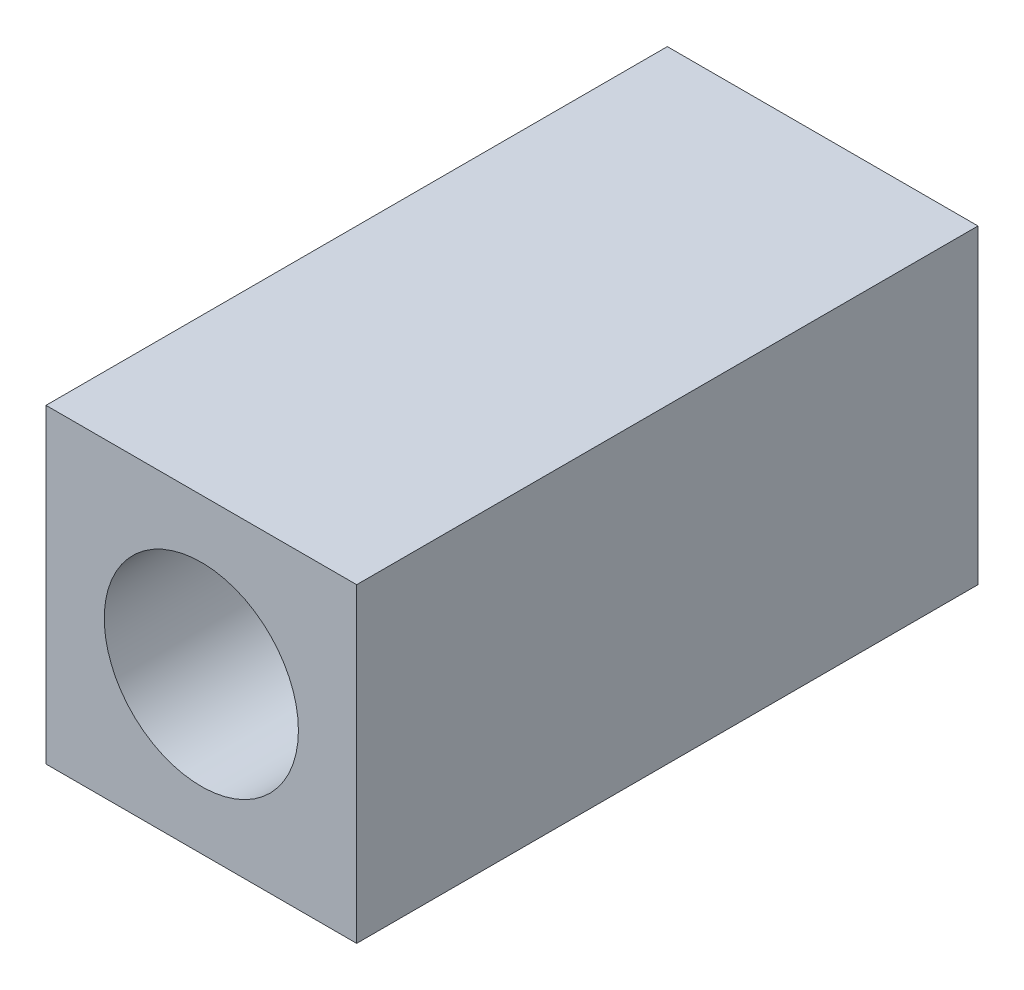
ISO-10303-21;
HEADER;
FILE_DESCRIPTION(('STEP AP214'),'2;1');
FILE_NAME('part.step','',(''),(''),'','','');
FILE_SCHEMA(('AUTOMOTIVE_DESIGN { 1 0 10303 214 1 1 1 1 }'));
ENDSEC;
DATA;
#1=APPLICATION_CONTEXT('core data for automotive mechanical design processes');
#2=APPLICATION_PROTOCOL_DEFINITION('international standard','automotive_design',2000,#1);
#3=PRODUCT_CONTEXT('',#1,'mechanical');
#4=PRODUCT('Part','Part','',(#3));
#5=PRODUCT_RELATED_PRODUCT_CATEGORY('part','',(#4));
#6=PRODUCT_DEFINITION_FORMATION('','',#4);
#7=PRODUCT_DEFINITION_CONTEXT('part definition',#1,'design');
#8=PRODUCT_DEFINITION('design','',#6,#7);
#9=PRODUCT_DEFINITION_SHAPE('','',#8);
#10=(LENGTH_UNIT() NAMED_UNIT(*) SI_UNIT(.MILLI.,.METRE.));
#11=(NAMED_UNIT(*) PLANE_ANGLE_UNIT() SI_UNIT($,.RADIAN.));
#12=(NAMED_UNIT(*) SI_UNIT($,.STERADIAN.) SOLID_ANGLE_UNIT());
#13=UNCERTAINTY_MEASURE_WITH_UNIT(LENGTH_MEASURE(1.E-05),#10,'distance_accuracy_value','');
#14=(GEOMETRIC_REPRESENTATION_CONTEXT(3) GLOBAL_UNCERTAINTY_ASSIGNED_CONTEXT((#13)) GLOBAL_UNIT_ASSIGNED_CONTEXT((#10,
#11,#12)) REPRESENTATION_CONTEXT('',''));
#15=CARTESIAN_POINT('',(0.,0.,0.));
#16=DIRECTION('',(0.,0.,1.));
#17=DIRECTION('',(1.,0.,0.));
#18=AXIS2_PLACEMENT_3D('',#15,#16,#17);
#19=CARTESIAN_POINT('',(-6.35,6.35,25.4));
#20=DIRECTION('',(1.,0.,0.));
#21=DIRECTION('',(0.,0.,-1.));
#22=AXIS2_PLACEMENT_3D('',#19,#20,#21);
#23=PLANE('',#22);
#24=DIRECTION('',(0.,-1.,0.));
#25=VECTOR('',#24,1.);
#26=CARTESIAN_POINT('',(-6.35,6.35,0.));
#27=LINE('',#26,#25);
#28=CARTESIAN_POINT('',(-6.35,6.35,0.));
#29=VERTEX_POINT('',#28);
#30=CARTESIAN_POINT('',(-6.35,-6.35,0.));
#31=VERTEX_POINT('',#30);
#32=EDGE_CURVE('E96',#29,#31,#27,.T.);
#33=ORIENTED_EDGE('',*,*,#32,.T.);
#34=DIRECTION('',(0.,0.,-1.));
#35=VECTOR('',#34,1.);
#36=CARTESIAN_POINT('',(-6.35,-6.35,25.4));
#37=LINE('',#36,#35);
#38=CARTESIAN_POINT('',(-6.35,-6.35,25.4));
#39=VERTEX_POINT('',#38);
#40=EDGE_CURVE('E11',#39,#31,#37,.T.);
#41=ORIENTED_EDGE('',*,*,#40,.F.);
#42=DIRECTION('',(0.,-1.,0.));
#43=VECTOR('',#42,1.);
#44=CARTESIAN_POINT('',(-6.35,6.35,25.4));
#45=LINE('',#44,#43);
#46=CARTESIAN_POINT('',(-6.35,6.35,25.4));
#47=VERTEX_POINT('',#46);
#48=EDGE_CURVE('E84',#47,#39,#45,.T.);
#49=ORIENTED_EDGE('',*,*,#48,.F.);
#50=DIRECTION('',(0.,0.,-1.));
#51=VECTOR('',#50,1.);
#52=CARTESIAN_POINT('',(-6.35,6.35,25.4));
#53=LINE('',#52,#51);
#54=EDGE_CURVE('E92',#47,#29,#53,.T.);
#55=ORIENTED_EDGE('',*,*,#54,.T.);
#56=EDGE_LOOP('',(#33,#41,#49,#55));
#57=FACE_BOUND('',#56,.T.);
#58=ADVANCED_FACE('F33',(#57),#23,.F.);
#59=CARTESIAN_POINT('',(-6.35,-6.35,25.4));
#60=DIRECTION('',(0.,1.,0.));
#61=DIRECTION('',(0.,0.,1.));
#62=AXIS2_PLACEMENT_3D('',#59,#60,#61);
#63=PLANE('',#62);
#64=DIRECTION('',(1.,0.,0.));
#65=VECTOR('',#64,1.);
#66=CARTESIAN_POINT('',(-6.35,-6.35,0.));
#67=LINE('',#66,#65);
#68=CARTESIAN_POINT('',(6.35,-6.35,0.));
#69=VERTEX_POINT('',#68);
#70=EDGE_CURVE('E88',#31,#69,#67,.T.);
#71=ORIENTED_EDGE('',*,*,#70,.T.);
#72=DIRECTION('',(0.,0.,-1.));
#73=VECTOR('',#72,1.);
#74=CARTESIAN_POINT('',(6.35,-6.35,25.4));
#75=LINE('',#74,#73);
#76=CARTESIAN_POINT('',(6.35,-6.35,25.4));
#77=VERTEX_POINT('',#76);
#78=EDGE_CURVE('E41',#77,#69,#75,.T.);
#79=ORIENTED_EDGE('',*,*,#78,.F.);
#80=DIRECTION('',(1.,0.,0.));
#81=VECTOR('',#80,1.);
#82=CARTESIAN_POINT('',(-6.35,-6.35,25.4));
#83=LINE('',#82,#81);
#84=EDGE_CURVE('E79',#39,#77,#83,.T.);
#85=ORIENTED_EDGE('',*,*,#84,.F.);
#86=ORIENTED_EDGE('',*,*,#40,.T.);
#87=EDGE_LOOP('',(#71,#79,#85,#86));
#88=FACE_BOUND('',#87,.T.);
#89=ADVANCED_FACE('F87',(#88),#63,.F.);
#90=CARTESIAN_POINT('',(6.35,-6.35,25.4));
#91=DIRECTION('',(-1.,0.,0.));
#92=DIRECTION('',(0.,0.,1.));
#93=AXIS2_PLACEMENT_3D('',#90,#91,#92);
#94=PLANE('',#93);
#95=DIRECTION('',(0.,1.,0.));
#96=VECTOR('',#95,1.);
#97=CARTESIAN_POINT('',(6.35,-6.35,0.));
#98=LINE('',#97,#96);
#99=CARTESIAN_POINT('',(6.35,6.35,0.));
#100=VERTEX_POINT('',#99);
#101=EDGE_CURVE('E66',#69,#100,#98,.T.);
#102=ORIENTED_EDGE('',*,*,#101,.T.);
#103=DIRECTION('',(0.,0.,-1.));
#104=VECTOR('',#103,1.);
#105=CARTESIAN_POINT('',(6.35,6.35,25.4));
#106=LINE('',#105,#104);
#107=CARTESIAN_POINT('',(6.35,6.35,25.4));
#108=VERTEX_POINT('',#107);
#109=EDGE_CURVE('E89',#108,#100,#106,.T.);
#110=ORIENTED_EDGE('',*,*,#109,.F.);
#111=DIRECTION('',(0.,1.,0.));
#112=VECTOR('',#111,1.);
#113=CARTESIAN_POINT('',(6.35,-6.35,25.4));
#114=LINE('',#113,#112);
#115=EDGE_CURVE('E82',#77,#108,#114,.T.);
#116=ORIENTED_EDGE('',*,*,#115,.F.);
#117=ORIENTED_EDGE('',*,*,#78,.T.);
#118=EDGE_LOOP('',(#102,#110,#116,#117));
#119=FACE_BOUND('',#118,.T.);
#120=ADVANCED_FACE('F90',(#119),#94,.F.);
#121=CARTESIAN_POINT('',(6.35,6.35,25.4));
#122=DIRECTION('',(0.,-1.,0.));
#123=DIRECTION('',(0.,0.,-1.));
#124=AXIS2_PLACEMENT_3D('',#121,#122,#123);
#125=PLANE('',#124);
#126=DIRECTION('',(-1.,0.,0.));
#127=VECTOR('',#126,1.);
#128=CARTESIAN_POINT('',(6.35,6.35,0.));
#129=LINE('',#128,#127);
#130=EDGE_CURVE('E72',#100,#29,#129,.T.);
#131=ORIENTED_EDGE('',*,*,#130,.T.);
#132=ORIENTED_EDGE('',*,*,#54,.F.);
#133=DIRECTION('',(-1.,0.,0.));
#134=VECTOR('',#133,1.);
#135=CARTESIAN_POINT('',(6.35,6.35,25.4));
#136=LINE('',#135,#134);
#137=EDGE_CURVE('E49',#108,#47,#136,.T.);
#138=ORIENTED_EDGE('',*,*,#137,.F.);
#139=ORIENTED_EDGE('',*,*,#109,.T.);
#140=EDGE_LOOP('',(#131,#132,#138,#139));
#141=FACE_BOUND('',#140,.T.);
#142=ADVANCED_FACE('F104',(#141),#125,.F.);
#143=CARTESIAN_POINT('',(0.,0.,25.4));
#144=DIRECTION('',(0.,0.,1.));
#145=DIRECTION('',(1.,0.,0.));
#146=AXIS2_PLACEMENT_3D('',#143,#144,#145);
#147=PLANE('',#146);
#148=CARTESIAN_POINT('',(0.,0.,25.4));
#149=DIRECTION('',(0.,0.,1.));
#150=DIRECTION('',(1.,0.,0.));
#151=AXIS2_PLACEMENT_3D('',#148,#149,#150);
#152=CIRCLE('',#151,3.96875);
#153=CARTESIAN_POINT('',(3.96875,0.,25.4));
#154=VERTEX_POINT('',#153);
#155=EDGE_CURVE('E116',#154,#154,#152,.T.);
#156=ORIENTED_EDGE('',*,*,#155,.F.);
#157=EDGE_LOOP('',(#156));
#158=FACE_BOUND('',#157,.T.);
#159=ORIENTED_EDGE('',*,*,#48,.T.);
#160=ORIENTED_EDGE('',*,*,#84,.T.);
#161=ORIENTED_EDGE('',*,*,#115,.T.);
#162=ORIENTED_EDGE('',*,*,#137,.T.);
#163=EDGE_LOOP('',(#159,#160,#161,#162));
#164=FACE_BOUND('',#163,.T.);
#165=ADVANCED_FACE('F80',(#158,#164),#147,.T.);
#166=CARTESIAN_POINT('',(0.,0.,0.));
#167=DIRECTION('',(0.,0.,1.));
#168=DIRECTION('',(1.,0.,0.));
#169=AXIS2_PLACEMENT_3D('',#166,#167,#168);
#170=PLANE('',#169);
#171=CARTESIAN_POINT('',(0.,0.,0.));
#172=DIRECTION('',(0.,0.,-1.));
#173=DIRECTION('',(-1.,0.,0.));
#174=AXIS2_PLACEMENT_3D('',#171,#172,#173);
#175=CIRCLE('',#174,3.175);
#176=CARTESIAN_POINT('',(-3.175,0.,0.));
#177=VERTEX_POINT('',#176);
#178=EDGE_CURVE('E99',#177,#177,#175,.T.);
#179=ORIENTED_EDGE('',*,*,#178,.F.);
#180=EDGE_LOOP('',(#179));
#181=FACE_BOUND('',#180,.T.);
#182=ORIENTED_EDGE('',*,*,#32,.F.);
#183=ORIENTED_EDGE('',*,*,#130,.F.);
#184=ORIENTED_EDGE('',*,*,#101,.F.);
#185=ORIENTED_EDGE('',*,*,#70,.F.);
#186=EDGE_LOOP('',(#182,#183,#184,#185));
#187=FACE_BOUND('',#186,.T.);
#188=ADVANCED_FACE('F107',(#181,#187),#170,.F.);
#189=CARTESIAN_POINT('',(0.,0.,12.7));
#190=DIRECTION('',(0.,0.,-1.));
#191=DIRECTION('',(-1.,0.,0.));
#192=AXIS2_PLACEMENT_3D('',#189,#190,#191);
#193=CYLINDRICAL_SURFACE('',#192,3.175);
#194=CARTESIAN_POINT('',(0.,0.,12.7));
#195=DIRECTION('',(0.,0.,-1.));
#196=DIRECTION('',(-1.,0.,0.));
#197=AXIS2_PLACEMENT_3D('',#194,#195,#196);
#198=CIRCLE('',#197,3.175);
#199=CARTESIAN_POINT('',(-3.175,0.,12.7));
#200=VERTEX_POINT('',#199);
#201=EDGE_CURVE('E112',#200,#200,#198,.T.);
#202=ORIENTED_EDGE('',*,*,#201,.F.);
#203=EDGE_LOOP('',(#202));
#204=FACE_BOUND('',#203,.T.);
#205=ORIENTED_EDGE('',*,*,#178,.T.);
#206=EDGE_LOOP('',(#205));
#207=FACE_BOUND('',#206,.T.);
#208=ADVANCED_FACE('F137',(#204,#207),#193,.F.);
#209=CARTESIAN_POINT('',(0.,0.,12.7));
#210=DIRECTION('',(0.,0.,1.));
#211=DIRECTION('',(1.,0.,0.));
#212=AXIS2_PLACEMENT_3D('',#209,#210,#211);
#213=PLANE('',#212);
#214=CARTESIAN_POINT('',(0.,0.,12.7));
#215=DIRECTION('',(0.,0.,1.));
#216=DIRECTION('',(1.,0.,0.));
#217=AXIS2_PLACEMENT_3D('',#214,#215,#216);
#218=CIRCLE('',#217,3.96875);
#219=CARTESIAN_POINT('',(3.96875,0.,12.7));
#220=VERTEX_POINT('',#219);
#221=EDGE_CURVE('E115',#220,#220,#218,.T.);
#222=ORIENTED_EDGE('',*,*,#221,.T.);
#223=EDGE_LOOP('',(#222));
#224=FACE_BOUND('',#223,.T.);
#225=ORIENTED_EDGE('',*,*,#201,.T.);
#226=EDGE_LOOP('',(#225));
#227=FACE_BOUND('',#226,.T.);
#228=ADVANCED_FACE('F122',(#224,#227),#213,.T.);
#229=CARTESIAN_POINT('',(0.,0.,12.7));
#230=DIRECTION('',(0.,0.,1.));
#231=DIRECTION('',(1.,0.,0.));
#232=AXIS2_PLACEMENT_3D('',#229,#230,#231);
#233=CYLINDRICAL_SURFACE('',#232,3.96875);
#234=ORIENTED_EDGE('',*,*,#221,.F.);
#235=EDGE_LOOP('',(#234));
#236=FACE_BOUND('',#235,.T.);
#237=ORIENTED_EDGE('',*,*,#155,.T.);
#238=EDGE_LOOP('',(#237));
#239=FACE_BOUND('',#238,.T.);
#240=ADVANCED_FACE('F125',(#236,#239),#233,.F.);
#241=CLOSED_SHELL('',(#58,#89,#120,#142,#165,#188,#208,#228,#240));
#242=MANIFOLD_SOLID_BREP('B2',#241);
#243=ADVANCED_BREP_SHAPE_REPRESENTATION('',(#18,#242),#14);
#244=SHAPE_DEFINITION_REPRESENTATION(#9,#243);
ENDSEC;
END-ISO-10303-21;
